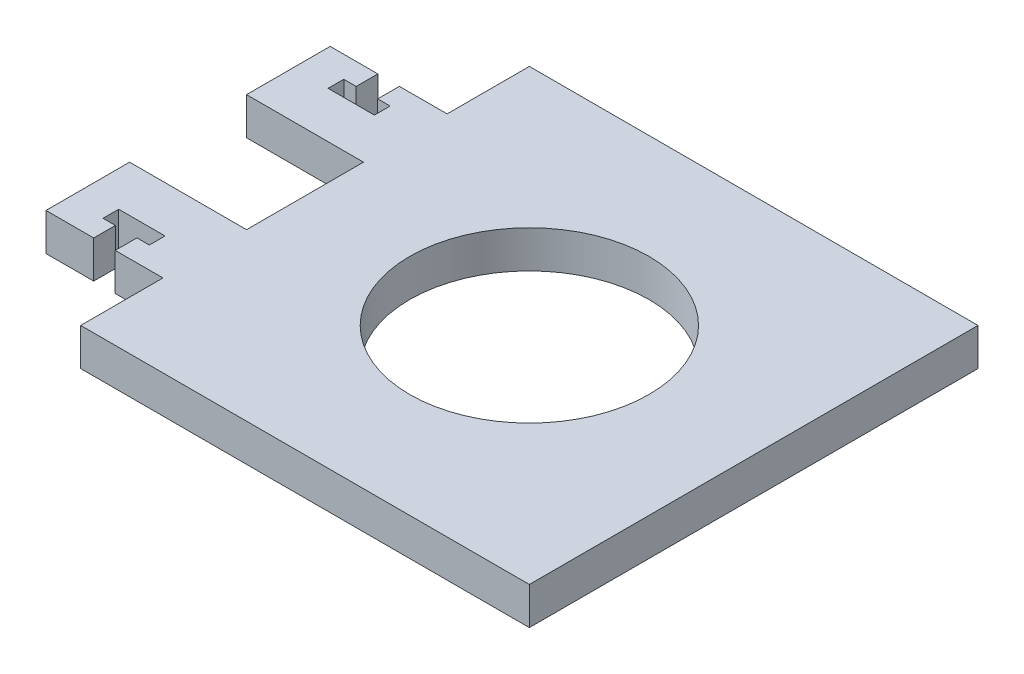
ISO-10303-21;
HEADER;
FILE_DESCRIPTION(('STEP AP214'),'2;1');
FILE_NAME('part.step','',(''),(''),'','','');
FILE_SCHEMA(('AUTOMOTIVE_DESIGN { 1 0 10303 214 1 1 1 1 }'));
ENDSEC;
DATA;
#1=APPLICATION_CONTEXT('core data for automotive mechanical design processes');
#2=APPLICATION_PROTOCOL_DEFINITION('international standard','automotive_design',2000,#1);
#3=PRODUCT_CONTEXT('',#1,'mechanical');
#4=PRODUCT('Part','Part','',(#3));
#5=PRODUCT_RELATED_PRODUCT_CATEGORY('part','',(#4));
#6=PRODUCT_DEFINITION_FORMATION('','',#4);
#7=PRODUCT_DEFINITION_CONTEXT('part definition',#1,'design');
#8=PRODUCT_DEFINITION('design','',#6,#7);
#9=PRODUCT_DEFINITION_SHAPE('','',#8);
#10=(LENGTH_UNIT() NAMED_UNIT(*) SI_UNIT(.MILLI.,.METRE.));
#11=(NAMED_UNIT(*) PLANE_ANGLE_UNIT() SI_UNIT($,.RADIAN.));
#12=(NAMED_UNIT(*) SI_UNIT($,.STERADIAN.) SOLID_ANGLE_UNIT());
#13=UNCERTAINTY_MEASURE_WITH_UNIT(LENGTH_MEASURE(1.E-05),#10,'distance_accuracy_value','');
#14=(GEOMETRIC_REPRESENTATION_CONTEXT(3) GLOBAL_UNCERTAINTY_ASSIGNED_CONTEXT((#13)) GLOBAL_UNIT_ASSIGNED_CONTEXT((#10,
#11,#12)) REPRESENTATION_CONTEXT('',''));
#15=CARTESIAN_POINT('',(0.,0.,0.));
#16=DIRECTION('',(0.,0.,1.));
#17=DIRECTION('',(1.,0.,0.));
#18=AXIS2_PLACEMENT_3D('',#15,#16,#17);
#19=CARTESIAN_POINT('',(38.1000000000002,-6.35,38.1000000000002));
#20=DIRECTION('',(1.,0.,0.));
#21=DIRECTION('',(0.,0.,-1.));
#22=AXIS2_PLACEMENT_3D('',#19,#20,#21);
#23=PLANE('',#22);
#24=DIRECTION('',(0.,0.,-1.));
#25=VECTOR('',#24,1.);
#26=CARTESIAN_POINT('',(38.1000000000002,0.,38.1000000000002));
#27=LINE('',#26,#25);
#28=CARTESIAN_POINT('',(38.1000000000002,0.,38.1000000000002));
#29=VERTEX_POINT('',#28);
#30=CARTESIAN_POINT('',(38.1000000000002,0.,-38.1000000000002));
#31=VERTEX_POINT('',#30);
#32=EDGE_CURVE('E251',#29,#31,#27,.T.);
#33=ORIENTED_EDGE('',*,*,#32,.F.);
#34=DIRECTION('',(0.,1.,0.));
#35=VECTOR('',#34,1.);
#36=CARTESIAN_POINT('',(38.1000000000002,-6.35,38.1000000000002));
#37=LINE('',#36,#35);
#38=CARTESIAN_POINT('',(38.1000000000002,-6.35,38.1000000000002));
#39=VERTEX_POINT('',#38);
#40=EDGE_CURVE('E11',#39,#29,#37,.T.);
#41=ORIENTED_EDGE('',*,*,#40,.F.);
#42=DIRECTION('',(0.,0.,-1.));
#43=VECTOR('',#42,1.);
#44=CARTESIAN_POINT('',(38.1000000000002,-6.35,38.1000000000002));
#45=LINE('',#44,#43);
#46=CARTESIAN_POINT('',(38.1000000000002,-6.35,-38.1000000000002));
#47=VERTEX_POINT('',#46);
#48=EDGE_CURVE('E332',#39,#47,#45,.T.);
#49=ORIENTED_EDGE('',*,*,#48,.T.);
#50=DIRECTION('',(0.,1.,0.));
#51=VECTOR('',#50,1.);
#52=CARTESIAN_POINT('',(38.1000000000002,-6.35,-38.1000000000002));
#53=LINE('',#52,#51);
#54=EDGE_CURVE('E37',#47,#31,#53,.T.);
#55=ORIENTED_EDGE('',*,*,#54,.T.);
#56=EDGE_LOOP('',(#33,#41,#49,#55));
#57=FACE_BOUND('',#56,.T.);
#58=ADVANCED_FACE('F34',(#57),#23,.T.);
#59=CARTESIAN_POINT('',(-38.0999999999998,-6.35,38.1000000000002));
#60=DIRECTION('',(0.,0.,1.));
#61=DIRECTION('',(1.,0.,0.));
#62=AXIS2_PLACEMENT_3D('',#59,#60,#61);
#63=PLANE('',#62);
#64=DIRECTION('',(1.,0.,0.));
#65=VECTOR('',#64,1.);
#66=CARTESIAN_POINT('',(-38.0999999999998,0.,38.1000000000002));
#67=LINE('',#66,#65);
#68=CARTESIAN_POINT('',(-38.0999999999998,0.,38.1000000000002));
#69=VERTEX_POINT('',#68);
#70=EDGE_CURVE('E330',#69,#29,#67,.T.);
#71=ORIENTED_EDGE('',*,*,#70,.F.);
#72=DIRECTION('',(0.,1.,0.));
#73=VECTOR('',#72,1.);
#74=CARTESIAN_POINT('',(-38.0999999999998,-6.35,38.1000000000002));
#75=LINE('',#74,#73);
#76=CARTESIAN_POINT('',(-38.0999999999998,-6.35,38.1000000000002));
#77=VERTEX_POINT('',#76);
#78=EDGE_CURVE('E43',#77,#69,#75,.T.);
#79=ORIENTED_EDGE('',*,*,#78,.F.);
#80=DIRECTION('',(1.,0.,0.));
#81=VECTOR('',#80,1.);
#82=CARTESIAN_POINT('',(-38.0999999999998,-6.35,38.1000000000002));
#83=LINE('',#82,#81);
#84=EDGE_CURVE('E241',#77,#39,#83,.T.);
#85=ORIENTED_EDGE('',*,*,#84,.T.);
#86=ORIENTED_EDGE('',*,*,#40,.T.);
#87=EDGE_LOOP('',(#71,#79,#85,#86));
#88=FACE_BOUND('',#87,.T.);
#89=ADVANCED_FACE('F384',(#88),#63,.T.);
#90=CARTESIAN_POINT('',(-38.0999999999998,-6.35,38.1000000000002));
#91=DIRECTION('',(-1.,0.,0.));
#92=DIRECTION('',(0.,0.,1.));
#93=AXIS2_PLACEMENT_3D('',#90,#91,#92);
#94=PLANE('',#93);
#95=DIRECTION('',(0.,0.,1.));
#96=VECTOR('',#95,1.);
#97=CARTESIAN_POINT('',(-38.0999999999998,0.,38.1000000000002));
#98=LINE('',#97,#96);
#99=CARTESIAN_POINT('',(-38.0999999999998,0.,24.1300000000002));
#100=VERTEX_POINT('',#99);
#101=EDGE_CURVE('E228',#100,#69,#98,.T.);
#102=ORIENTED_EDGE('',*,*,#101,.F.);
#103=DIRECTION('',(0.,1.,0.));
#104=VECTOR('',#103,1.);
#105=CARTESIAN_POINT('',(-38.0999999999998,-6.35,24.1300000000002));
#106=LINE('',#105,#104);
#107=CARTESIAN_POINT('',(-38.0999999999998,-6.35,24.1300000000002));
#108=VERTEX_POINT('',#107);
#109=EDGE_CURVE('E223',#108,#100,#106,.T.);
#110=ORIENTED_EDGE('',*,*,#109,.F.);
#111=DIRECTION('',(0.,0.,1.));
#112=VECTOR('',#111,1.);
#113=CARTESIAN_POINT('',(-38.0999999999998,-6.35,38.1000000000002));
#114=LINE('',#113,#112);
#115=EDGE_CURVE('E226',#108,#77,#114,.T.);
#116=ORIENTED_EDGE('',*,*,#115,.T.);
#117=ORIENTED_EDGE('',*,*,#78,.T.);
#118=EDGE_LOOP('',(#102,#110,#116,#117));
#119=FACE_BOUND('',#118,.T.);
#120=ADVANCED_FACE('F225',(#119),#94,.T.);
#121=CARTESIAN_POINT('',(-38.0999999999998,-6.35,24.1300000000002));
#122=DIRECTION('',(0.,0.,1.));
#123=DIRECTION('',(1.,0.,0.));
#124=AXIS2_PLACEMENT_3D('',#121,#122,#123);
#125=PLANE('',#124);
#126=DIRECTION('',(1.,0.,0.));
#127=VECTOR('',#126,1.);
#128=CARTESIAN_POINT('',(-38.0999999999998,0.,24.1300000000002));
#129=LINE('',#128,#127);
#130=CARTESIAN_POINT('',(-46.2025999999998,0.,24.1300000000001));
#131=VERTEX_POINT('',#130);
#132=EDGE_CURVE('E327',#131,#100,#129,.T.);
#133=ORIENTED_EDGE('',*,*,#132,.F.);
#134=DIRECTION('',(0.,1.,0.));
#135=VECTOR('',#134,1.);
#136=CARTESIAN_POINT('',(-46.2025999999998,-6.35,24.1300000000001));
#137=LINE('',#136,#135);
#138=CARTESIAN_POINT('',(-46.2025999999998,-6.35,24.1300000000001));
#139=VERTEX_POINT('',#138);
#140=EDGE_CURVE('E233',#139,#131,#137,.T.);
#141=ORIENTED_EDGE('',*,*,#140,.F.);
#142=DIRECTION('',(1.,0.,0.));
#143=VECTOR('',#142,1.);
#144=CARTESIAN_POINT('',(-38.0999999999998,-6.35,24.1300000000002));
#145=LINE('',#144,#143);
#146=EDGE_CURVE('E239',#139,#108,#145,.T.);
#147=ORIENTED_EDGE('',*,*,#146,.T.);
#148=ORIENTED_EDGE('',*,*,#109,.T.);
#149=EDGE_LOOP('',(#133,#141,#147,#148));
#150=FACE_BOUND('',#149,.T.);
#151=ADVANCED_FACE('F243',(#150),#125,.T.);
#152=CARTESIAN_POINT('',(-46.2025999999998,-6.35,24.1300000000001));
#153=DIRECTION('',(-1.,0.,0.));
#154=DIRECTION('',(0.,0.,1.));
#155=AXIS2_PLACEMENT_3D('',#152,#153,#154);
#156=PLANE('',#155);
#157=DIRECTION('',(0.,0.,1.));
#158=VECTOR('',#157,1.);
#159=CARTESIAN_POINT('',(-46.2025999999998,0.,24.1300000000001));
#160=LINE('',#159,#158);
#161=CARTESIAN_POINT('',(-46.2025999999998,0.,20.4470000000001));
#162=VERTEX_POINT('',#161);
#163=EDGE_CURVE('E324',#162,#131,#160,.T.);
#164=ORIENTED_EDGE('',*,*,#163,.F.);
#165=DIRECTION('',(0.,1.,0.));
#166=VECTOR('',#165,1.);
#167=CARTESIAN_POINT('',(-46.2025999999998,-6.35,20.4470000000001));
#168=LINE('',#167,#166);
#169=CARTESIAN_POINT('',(-46.2025999999998,-6.35,20.4470000000001));
#170=VERTEX_POINT('',#169);
#171=EDGE_CURVE('E336',#170,#162,#168,.T.);
#172=ORIENTED_EDGE('',*,*,#171,.F.);
#173=DIRECTION('',(0.,0.,1.));
#174=VECTOR('',#173,1.);
#175=CARTESIAN_POINT('',(-46.2025999999998,-6.35,24.1300000000001));
#176=LINE('',#175,#174);
#177=EDGE_CURVE('E244',#170,#139,#176,.T.);
#178=ORIENTED_EDGE('',*,*,#177,.T.);
#179=ORIENTED_EDGE('',*,*,#140,.T.);
#180=EDGE_LOOP('',(#164,#172,#178,#179));
#181=FACE_BOUND('',#180,.T.);
#182=ADVANCED_FACE('F397',(#181),#156,.T.);
#183=CARTESIAN_POINT('',(-46.2025999999998,-6.35,20.4470000000001));
#184=DIRECTION('',(0.,0.,-1.));
#185=DIRECTION('',(-1.,0.,0.));
#186=AXIS2_PLACEMENT_3D('',#183,#184,#185);
#187=PLANE('',#186);
#188=DIRECTION('',(-1.,0.,0.));
#189=VECTOR('',#188,1.);
#190=CARTESIAN_POINT('',(-46.2025999999998,0.,20.4470000000001));
#191=LINE('',#190,#189);
#192=CARTESIAN_POINT('',(-44.0943999999998,0.,20.4470000000001));
#193=VERTEX_POINT('',#192);
#194=EDGE_CURVE('E321',#193,#162,#191,.T.);
#195=ORIENTED_EDGE('',*,*,#194,.F.);
#196=DIRECTION('',(0.,1.,0.));
#197=VECTOR('',#196,1.);
#198=CARTESIAN_POINT('',(-44.0943999999998,-6.35,20.4470000000001));
#199=LINE('',#198,#197);
#200=CARTESIAN_POINT('',(-44.0943999999998,-6.35,20.4470000000001));
#201=VERTEX_POINT('',#200);
#202=EDGE_CURVE('E338',#201,#193,#199,.T.);
#203=ORIENTED_EDGE('',*,*,#202,.F.);
#204=DIRECTION('',(-1.,0.,0.));
#205=VECTOR('',#204,1.);
#206=CARTESIAN_POINT('',(-46.2025999999998,-6.35,20.4470000000001));
#207=LINE('',#206,#205);
#208=EDGE_CURVE('E246',#201,#170,#207,.T.);
#209=ORIENTED_EDGE('',*,*,#208,.T.);
#210=ORIENTED_EDGE('',*,*,#171,.T.);
#211=EDGE_LOOP('',(#195,#203,#209,#210));
#212=FACE_BOUND('',#211,.T.);
#213=ADVANCED_FACE('F400',(#212),#187,.T.);
#214=CARTESIAN_POINT('',(-44.0943999999998,-6.35,20.4470000000001));
#215=DIRECTION('',(-1.,0.,0.));
#216=DIRECTION('',(0.,0.,1.));
#217=AXIS2_PLACEMENT_3D('',#214,#215,#216);
#218=PLANE('',#217);
#219=DIRECTION('',(0.,0.,1.));
#220=VECTOR('',#219,1.);
#221=CARTESIAN_POINT('',(-44.0943999999998,0.,20.4470000000001));
#222=LINE('',#221,#220);
#223=CARTESIAN_POINT('',(-44.0943999999998,0.,17.7800000000002));
#224=VERTEX_POINT('',#223);
#225=EDGE_CURVE('E318',#224,#193,#222,.T.);
#226=ORIENTED_EDGE('',*,*,#225,.F.);
#227=DIRECTION('',(0.,1.,0.));
#228=VECTOR('',#227,1.);
#229=CARTESIAN_POINT('',(-44.0943999999998,-6.35,17.7800000000002));
#230=LINE('',#229,#228);
#231=CARTESIAN_POINT('',(-44.0943999999998,-6.35,17.7800000000002));
#232=VERTEX_POINT('',#231);
#233=EDGE_CURVE('E340',#232,#224,#230,.T.);
#234=ORIENTED_EDGE('',*,*,#233,.F.);
#235=DIRECTION('',(0.,0.,1.));
#236=VECTOR('',#235,1.);
#237=CARTESIAN_POINT('',(-44.0943999999998,-6.35,20.4470000000001));
#238=LINE('',#237,#236);
#239=EDGE_CURVE('E575',#232,#201,#238,.T.);
#240=ORIENTED_EDGE('',*,*,#239,.T.);
#241=ORIENTED_EDGE('',*,*,#202,.T.);
#242=EDGE_LOOP('',(#226,#234,#240,#241));
#243=FACE_BOUND('',#242,.T.);
#244=ADVANCED_FACE('F404',(#243),#218,.T.);
#245=CARTESIAN_POINT('',(-44.0943999999998,-6.35,17.7800000000002));
#246=DIRECTION('',(0.,0.,1.));
#247=DIRECTION('',(1.,0.,0.));
#248=AXIS2_PLACEMENT_3D('',#245,#246,#247);
#249=PLANE('',#248);
#250=DIRECTION('',(1.,0.,0.));
#251=VECTOR('',#250,1.);
#252=CARTESIAN_POINT('',(-44.0943999999998,0.,17.7800000000002));
#253=LINE('',#252,#251);
#254=CARTESIAN_POINT('',(-51.9683999999998,0.,17.7800000000002));
#255=VERTEX_POINT('',#254);
#256=EDGE_CURVE('E315',#255,#224,#253,.T.);
#257=ORIENTED_EDGE('',*,*,#256,.F.);
#258=DIRECTION('',(0.,1.,0.));
#259=VECTOR('',#258,1.);
#260=CARTESIAN_POINT('',(-51.9683999999998,-6.35,17.7800000000002));
#261=LINE('',#260,#259);
#262=CARTESIAN_POINT('',(-51.9683999999998,-6.35,17.7800000000002));
#263=VERTEX_POINT('',#262);
#264=EDGE_CURVE('E342',#263,#255,#261,.T.);
#265=ORIENTED_EDGE('',*,*,#264,.F.);
#266=DIRECTION('',(1.,0.,0.));
#267=VECTOR('',#266,1.);
#268=CARTESIAN_POINT('',(-44.0943999999998,-6.35,17.7800000000002));
#269=LINE('',#268,#267);
#270=EDGE_CURVE('E572',#263,#232,#269,.T.);
#271=ORIENTED_EDGE('',*,*,#270,.T.);
#272=ORIENTED_EDGE('',*,*,#233,.T.);
#273=EDGE_LOOP('',(#257,#265,#271,#272));
#274=FACE_BOUND('',#273,.T.);
#275=ADVANCED_FACE('F408',(#274),#249,.T.);
#276=CARTESIAN_POINT('',(-51.9683999999998,-6.35,20.4470000000001));
#277=DIRECTION('',(1.,0.,0.));
#278=DIRECTION('',(0.,0.,-1.));
#279=AXIS2_PLACEMENT_3D('',#276,#277,#278);
#280=PLANE('',#279);
#281=DIRECTION('',(0.,0.,-1.));
#282=VECTOR('',#281,1.);
#283=CARTESIAN_POINT('',(-51.9683999999998,0.,20.4470000000001));
#284=LINE('',#283,#282);
#285=CARTESIAN_POINT('',(-51.9683999999998,0.,20.4470000000001));
#286=VERTEX_POINT('',#285);
#287=EDGE_CURVE('E312',#286,#255,#284,.T.);
#288=ORIENTED_EDGE('',*,*,#287,.F.);
#289=DIRECTION('',(0.,1.,0.));
#290=VECTOR('',#289,1.);
#291=CARTESIAN_POINT('',(-51.9683999999998,-6.35,20.4470000000001));
#292=LINE('',#291,#290);
#293=CARTESIAN_POINT('',(-51.9683999999998,-6.35,20.4470000000001));
#294=VERTEX_POINT('',#293);
#295=EDGE_CURVE('E344',#294,#286,#292,.T.);
#296=ORIENTED_EDGE('',*,*,#295,.F.);
#297=DIRECTION('',(0.,0.,-1.));
#298=VECTOR('',#297,1.);
#299=CARTESIAN_POINT('',(-51.9683999999998,-6.35,20.4470000000001));
#300=LINE('',#299,#298);
#301=EDGE_CURVE('E569',#294,#263,#300,.T.);
#302=ORIENTED_EDGE('',*,*,#301,.T.);
#303=ORIENTED_EDGE('',*,*,#264,.T.);
#304=EDGE_LOOP('',(#288,#296,#302,#303));
#305=FACE_BOUND('',#304,.T.);
#306=ADVANCED_FACE('F412',(#305),#280,.T.);
#307=CARTESIAN_POINT('',(-49.8601999999998,-6.35,20.4470000000001));
#308=DIRECTION('',(0.,0.,-1.));
#309=DIRECTION('',(-1.,0.,0.));
#310=AXIS2_PLACEMENT_3D('',#307,#308,#309);
#311=PLANE('',#310);
#312=DIRECTION('',(-1.,0.,0.));
#313=VECTOR('',#312,1.);
#314=CARTESIAN_POINT('',(-49.8601999999998,0.,20.4470000000001));
#315=LINE('',#314,#313);
#316=CARTESIAN_POINT('',(-49.8601999999998,0.,20.4470000000001));
#317=VERTEX_POINT('',#316);
#318=EDGE_CURVE('E309',#317,#286,#315,.T.);
#319=ORIENTED_EDGE('',*,*,#318,.F.);
#320=DIRECTION('',(0.,1.,0.));
#321=VECTOR('',#320,1.);
#322=CARTESIAN_POINT('',(-49.8601999999998,-6.35,20.4470000000001));
#323=LINE('',#322,#321);
#324=CARTESIAN_POINT('',(-49.8601999999998,-6.35,20.4470000000001));
#325=VERTEX_POINT('',#324);
#326=EDGE_CURVE('E346',#325,#317,#323,.T.);
#327=ORIENTED_EDGE('',*,*,#326,.F.);
#328=DIRECTION('',(-1.,0.,0.));
#329=VECTOR('',#328,1.);
#330=CARTESIAN_POINT('',(-49.8601999999998,-6.35,20.4470000000001));
#331=LINE('',#330,#329);
#332=EDGE_CURVE('E566',#325,#294,#331,.T.);
#333=ORIENTED_EDGE('',*,*,#332,.T.);
#334=ORIENTED_EDGE('',*,*,#295,.T.);
#335=EDGE_LOOP('',(#319,#327,#333,#334));
#336=FACE_BOUND('',#335,.T.);
#337=ADVANCED_FACE('F416',(#336),#311,.T.);
#338=CARTESIAN_POINT('',(-49.8601999999998,-6.35,24.1300000000001));
#339=DIRECTION('',(1.,0.,0.));
#340=DIRECTION('',(0.,0.,-1.));
#341=AXIS2_PLACEMENT_3D('',#338,#339,#340);
#342=PLANE('',#341);
#343=DIRECTION('',(0.,0.,-1.));
#344=VECTOR('',#343,1.);
#345=CARTESIAN_POINT('',(-49.8601999999998,0.,24.1300000000001));
#346=LINE('',#345,#344);
#347=CARTESIAN_POINT('',(-49.8601999999998,0.,24.1300000000001));
#348=VERTEX_POINT('',#347);
#349=EDGE_CURVE('E306',#348,#317,#346,.T.);
#350=ORIENTED_EDGE('',*,*,#349,.F.);
#351=DIRECTION('',(0.,1.,0.));
#352=VECTOR('',#351,1.);
#353=CARTESIAN_POINT('',(-49.8601999999998,-6.35,24.1300000000001));
#354=LINE('',#353,#352);
#355=CARTESIAN_POINT('',(-49.8601999999998,-6.35,24.1300000000001));
#356=VERTEX_POINT('',#355);
#357=EDGE_CURVE('E348',#356,#348,#354,.T.);
#358=ORIENTED_EDGE('',*,*,#357,.F.);
#359=DIRECTION('',(0.,0.,-1.));
#360=VECTOR('',#359,1.);
#361=CARTESIAN_POINT('',(-49.8601999999998,-6.35,24.1300000000001));
#362=LINE('',#361,#360);
#363=EDGE_CURVE('E563',#356,#325,#362,.T.);
#364=ORIENTED_EDGE('',*,*,#363,.T.);
#365=ORIENTED_EDGE('',*,*,#326,.T.);
#366=EDGE_LOOP('',(#350,#358,#364,#365));
#367=FACE_BOUND('',#366,.T.);
#368=ADVANCED_FACE('F420',(#367),#342,.T.);
#369=CARTESIAN_POINT('',(-49.8601999999998,-6.35,24.1300000000001));
#370=DIRECTION('',(0.,0.,1.));
#371=DIRECTION('',(1.,0.,0.));
#372=AXIS2_PLACEMENT_3D('',#369,#370,#371);
#373=PLANE('',#372);
#374=DIRECTION('',(1.,0.,0.));
#375=VECTOR('',#374,1.);
#376=CARTESIAN_POINT('',(-49.8601999999998,0.,24.1300000000001));
#377=LINE('',#376,#375);
#378=CARTESIAN_POINT('',(-57.9627999999998,0.,24.1300000000002));
#379=VERTEX_POINT('',#378);
#380=EDGE_CURVE('E303',#379,#348,#377,.T.);
#381=ORIENTED_EDGE('',*,*,#380,.F.);
#382=DIRECTION('',(0.,1.,0.));
#383=VECTOR('',#382,1.);
#384=CARTESIAN_POINT('',(-57.9627999999998,-6.35,24.1300000000002));
#385=LINE('',#384,#383);
#386=CARTESIAN_POINT('',(-57.9627999999998,-6.35,24.1300000000002));
#387=VERTEX_POINT('',#386);
#388=EDGE_CURVE('E350',#387,#379,#385,.T.);
#389=ORIENTED_EDGE('',*,*,#388,.F.);
#390=DIRECTION('',(1.,0.,0.));
#391=VECTOR('',#390,1.);
#392=CARTESIAN_POINT('',(-49.8601999999998,-6.35,24.1300000000001));
#393=LINE('',#392,#391);
#394=EDGE_CURVE('E560',#387,#356,#393,.T.);
#395=ORIENTED_EDGE('',*,*,#394,.T.);
#396=ORIENTED_EDGE('',*,*,#357,.T.);
#397=EDGE_LOOP('',(#381,#389,#395,#396));
#398=FACE_BOUND('',#397,.T.);
#399=ADVANCED_FACE('F424',(#398),#373,.T.);
#400=CARTESIAN_POINT('',(-57.9627999999998,-6.35,24.1300000000002));
#401=DIRECTION('',(-1.,0.,0.));
#402=DIRECTION('',(0.,0.,1.));
#403=AXIS2_PLACEMENT_3D('',#400,#401,#402);
#404=PLANE('',#403);
#405=DIRECTION('',(0.,0.,1.));
#406=VECTOR('',#405,1.);
#407=CARTESIAN_POINT('',(-57.9627999999998,0.,24.1300000000002));
#408=LINE('',#407,#406);
#409=CARTESIAN_POINT('',(-57.9627999999998,0.,9.93140000000015));
#410=VERTEX_POINT('',#409);
#411=EDGE_CURVE('E300',#410,#379,#408,.T.);
#412=ORIENTED_EDGE('',*,*,#411,.F.);
#413=DIRECTION('',(0.,1.,0.));
#414=VECTOR('',#413,1.);
#415=CARTESIAN_POINT('',(-57.9627999999998,-6.35,9.93140000000015));
#416=LINE('',#415,#414);
#417=CARTESIAN_POINT('',(-57.9627999999998,-6.35,9.93140000000015));
#418=VERTEX_POINT('',#417);
#419=EDGE_CURVE('E352',#418,#410,#416,.T.);
#420=ORIENTED_EDGE('',*,*,#419,.F.);
#421=DIRECTION('',(0.,0.,1.));
#422=VECTOR('',#421,1.);
#423=CARTESIAN_POINT('',(-57.9627999999998,-6.35,24.1300000000002));
#424=LINE('',#423,#422);
#425=EDGE_CURVE('E557',#418,#387,#424,.T.);
#426=ORIENTED_EDGE('',*,*,#425,.T.);
#427=ORIENTED_EDGE('',*,*,#388,.T.);
#428=EDGE_LOOP('',(#412,#420,#426,#427));
#429=FACE_BOUND('',#428,.T.);
#430=ADVANCED_FACE('F428',(#429),#404,.T.);
#431=CARTESIAN_POINT('',(-57.9627999999998,-6.35,9.93140000000015));
#432=DIRECTION('',(0.,0.,-1.));
#433=DIRECTION('',(-1.,0.,0.));
#434=AXIS2_PLACEMENT_3D('',#431,#432,#433);
#435=PLANE('',#434);
#436=DIRECTION('',(-1.,0.,0.));
#437=VECTOR('',#436,1.);
#438=CARTESIAN_POINT('',(-57.9627999999998,0.,9.93140000000015));
#439=LINE('',#438,#437);
#440=CARTESIAN_POINT('',(-38.0999999999998,0.,9.93140000000015));
#441=VERTEX_POINT('',#440);
#442=EDGE_CURVE('E297',#441,#410,#439,.T.);
#443=ORIENTED_EDGE('',*,*,#442,.F.);
#444=DIRECTION('',(0.,1.,0.));
#445=VECTOR('',#444,1.);
#446=CARTESIAN_POINT('',(-38.0999999999998,-6.35,9.93140000000015));
#447=LINE('',#446,#445);
#448=CARTESIAN_POINT('',(-38.0999999999998,-6.35,9.93140000000015));
#449=VERTEX_POINT('',#448);
#450=EDGE_CURVE('E354',#449,#441,#447,.T.);
#451=ORIENTED_EDGE('',*,*,#450,.F.);
#452=DIRECTION('',(-1.,0.,0.));
#453=VECTOR('',#452,1.);
#454=CARTESIAN_POINT('',(-57.9627999999998,-6.35,9.93140000000015));
#455=LINE('',#454,#453);
#456=EDGE_CURVE('E554',#449,#418,#455,.T.);
#457=ORIENTED_EDGE('',*,*,#456,.T.);
#458=ORIENTED_EDGE('',*,*,#419,.T.);
#459=EDGE_LOOP('',(#443,#451,#457,#458));
#460=FACE_BOUND('',#459,.T.);
#461=ADVANCED_FACE('F432',(#460),#435,.T.);
#462=CARTESIAN_POINT('',(-38.0999999999998,-6.35,9.93140000000015));
#463=DIRECTION('',(-1.,0.,0.));
#464=DIRECTION('',(0.,0.,1.));
#465=AXIS2_PLACEMENT_3D('',#462,#463,#464);
#466=PLANE('',#465);
#467=DIRECTION('',(0.,0.,1.));
#468=VECTOR('',#467,1.);
#469=CARTESIAN_POINT('',(-38.0999999999998,0.,9.93140000000015));
#470=LINE('',#469,#468);
#471=CARTESIAN_POINT('',(-38.0999999999998,0.,-9.93140000000021));
#472=VERTEX_POINT('',#471);
#473=EDGE_CURVE('E294',#472,#441,#470,.T.);
#474=ORIENTED_EDGE('',*,*,#473,.F.);
#475=DIRECTION('',(0.,1.,0.));
#476=VECTOR('',#475,1.);
#477=CARTESIAN_POINT('',(-38.0999999999998,-6.35,-9.93140000000021));
#478=LINE('',#477,#476);
#479=CARTESIAN_POINT('',(-38.0999999999998,-6.35,-9.93140000000021));
#480=VERTEX_POINT('',#479);
#481=EDGE_CURVE('E356',#480,#472,#478,.T.);
#482=ORIENTED_EDGE('',*,*,#481,.F.);
#483=DIRECTION('',(0.,0.,1.));
#484=VECTOR('',#483,1.);
#485=CARTESIAN_POINT('',(-38.0999999999998,-6.35,9.93140000000015));
#486=LINE('',#485,#484);
#487=EDGE_CURVE('E551',#480,#449,#486,.T.);
#488=ORIENTED_EDGE('',*,*,#487,.T.);
#489=ORIENTED_EDGE('',*,*,#450,.T.);
#490=EDGE_LOOP('',(#474,#482,#488,#489));
#491=FACE_BOUND('',#490,.T.);
#492=ADVANCED_FACE('F436',(#491),#466,.T.);
#493=CARTESIAN_POINT('',(-57.9627999999998,-6.35,-9.93140000000022));
#494=DIRECTION('',(0.,0.,1.));
#495=DIRECTION('',(1.,0.,0.));
#496=AXIS2_PLACEMENT_3D('',#493,#494,#495);
#497=PLANE('',#496);
#498=DIRECTION('',(1.,0.,0.));
#499=VECTOR('',#498,1.);
#500=CARTESIAN_POINT('',(-57.9627999999998,0.,-9.93140000000022));
#501=LINE('',#500,#499);
#502=CARTESIAN_POINT('',(-57.9627999999998,0.,-9.93140000000022));
#503=VERTEX_POINT('',#502);
#504=EDGE_CURVE('E291',#503,#472,#501,.T.);
#505=ORIENTED_EDGE('',*,*,#504,.F.);
#506=DIRECTION('',(0.,1.,0.));
#507=VECTOR('',#506,1.);
#508=CARTESIAN_POINT('',(-57.9627999999998,-6.35,-9.93140000000022));
#509=LINE('',#508,#507);
#510=CARTESIAN_POINT('',(-57.9627999999998,-6.35,-9.93140000000022));
#511=VERTEX_POINT('',#510);
#512=EDGE_CURVE('E358',#511,#503,#509,.T.);
#513=ORIENTED_EDGE('',*,*,#512,.F.);
#514=DIRECTION('',(1.,0.,0.));
#515=VECTOR('',#514,1.);
#516=CARTESIAN_POINT('',(-57.9627999999998,-6.35,-9.93140000000022));
#517=LINE('',#516,#515);
#518=EDGE_CURVE('E548',#511,#480,#517,.T.);
#519=ORIENTED_EDGE('',*,*,#518,.T.);
#520=ORIENTED_EDGE('',*,*,#481,.T.);
#521=EDGE_LOOP('',(#505,#513,#519,#520));
#522=FACE_BOUND('',#521,.T.);
#523=ADVANCED_FACE('F440',(#522),#497,.T.);
#524=CARTESIAN_POINT('',(-57.9627999999998,-6.35,-24.1300000000002));
#525=DIRECTION('',(-1.,0.,0.));
#526=DIRECTION('',(0.,0.,1.));
#527=AXIS2_PLACEMENT_3D('',#524,#525,#526);
#528=PLANE('',#527);
#529=DIRECTION('',(0.,0.,1.));
#530=VECTOR('',#529,1.);
#531=CARTESIAN_POINT('',(-57.9627999999998,0.,-24.1300000000002));
#532=LINE('',#531,#530);
#533=CARTESIAN_POINT('',(-57.9627999999998,0.,-24.1300000000002));
#534=VERTEX_POINT('',#533);
#535=EDGE_CURVE('E288',#534,#503,#532,.T.);
#536=ORIENTED_EDGE('',*,*,#535,.F.);
#537=DIRECTION('',(0.,1.,0.));
#538=VECTOR('',#537,1.);
#539=CARTESIAN_POINT('',(-57.9627999999998,-6.35,-24.1300000000002));
#540=LINE('',#539,#538);
#541=CARTESIAN_POINT('',(-57.9627999999998,-6.35,-24.1300000000002));
#542=VERTEX_POINT('',#541);
#543=EDGE_CURVE('E360',#542,#534,#540,.T.);
#544=ORIENTED_EDGE('',*,*,#543,.F.);
#545=DIRECTION('',(0.,0.,1.));
#546=VECTOR('',#545,1.);
#547=CARTESIAN_POINT('',(-57.9627999999998,-6.35,-24.1300000000002));
#548=LINE('',#547,#546);
#549=EDGE_CURVE('E545',#542,#511,#548,.T.);
#550=ORIENTED_EDGE('',*,*,#549,.T.);
#551=ORIENTED_EDGE('',*,*,#512,.T.);
#552=EDGE_LOOP('',(#536,#544,#550,#551));
#553=FACE_BOUND('',#552,.T.);
#554=ADVANCED_FACE('F444',(#553),#528,.T.);
#555=CARTESIAN_POINT('',(-49.8601999999998,-6.35,-24.1300000000002));
#556=DIRECTION('',(0.,0.,-1.));
#557=DIRECTION('',(-1.,0.,0.));
#558=AXIS2_PLACEMENT_3D('',#555,#556,#557);
#559=PLANE('',#558);
#560=DIRECTION('',(-1.,0.,0.));
#561=VECTOR('',#560,1.);
#562=CARTESIAN_POINT('',(-49.8601999999998,0.,-24.1300000000002));
#563=LINE('',#562,#561);
#564=CARTESIAN_POINT('',(-49.8601999999998,0.,-24.1300000000002));
#565=VERTEX_POINT('',#564);
#566=EDGE_CURVE('E285',#565,#534,#563,.T.);
#567=ORIENTED_EDGE('',*,*,#566,.F.);
#568=DIRECTION('',(0.,1.,0.));
#569=VECTOR('',#568,1.);
#570=CARTESIAN_POINT('',(-49.8601999999998,-6.35,-24.1300000000002));
#571=LINE('',#570,#569);
#572=CARTESIAN_POINT('',(-49.8601999999998,-6.35,-24.1300000000002));
#573=VERTEX_POINT('',#572);
#574=EDGE_CURVE('E362',#573,#565,#571,.T.);
#575=ORIENTED_EDGE('',*,*,#574,.F.);
#576=DIRECTION('',(-1.,0.,0.));
#577=VECTOR('',#576,1.);
#578=CARTESIAN_POINT('',(-49.8601999999998,-6.35,-24.1300000000002));
#579=LINE('',#578,#577);
#580=EDGE_CURVE('E542',#573,#542,#579,.T.);
#581=ORIENTED_EDGE('',*,*,#580,.T.);
#582=ORIENTED_EDGE('',*,*,#543,.T.);
#583=EDGE_LOOP('',(#567,#575,#581,#582));
#584=FACE_BOUND('',#583,.T.);
#585=ADVANCED_FACE('F448',(#584),#559,.T.);
#586=CARTESIAN_POINT('',(-49.8601999999998,-6.35,-24.1300000000002));
#587=DIRECTION('',(1.,0.,0.));
#588=DIRECTION('',(0.,0.,-1.));
#589=AXIS2_PLACEMENT_3D('',#586,#587,#588);
#590=PLANE('',#589);
#591=DIRECTION('',(0.,0.,-1.));
#592=VECTOR('',#591,1.);
#593=CARTESIAN_POINT('',(-49.8601999999998,0.,-24.1300000000002));
#594=LINE('',#593,#592);
#595=CARTESIAN_POINT('',(-49.8601999999998,0.,-20.4470000000002));
#596=VERTEX_POINT('',#595);
#597=EDGE_CURVE('E282',#596,#565,#594,.T.);
#598=ORIENTED_EDGE('',*,*,#597,.F.);
#599=DIRECTION('',(0.,1.,0.));
#600=VECTOR('',#599,1.);
#601=CARTESIAN_POINT('',(-49.8601999999998,-6.35,-20.4470000000002));
#602=LINE('',#601,#600);
#603=CARTESIAN_POINT('',(-49.8601999999998,-6.35,-20.4470000000002));
#604=VERTEX_POINT('',#603);
#605=EDGE_CURVE('E364',#604,#596,#602,.T.);
#606=ORIENTED_EDGE('',*,*,#605,.F.);
#607=DIRECTION('',(0.,0.,-1.));
#608=VECTOR('',#607,1.);
#609=CARTESIAN_POINT('',(-49.8601999999998,-6.35,-24.1300000000002));
#610=LINE('',#609,#608);
#611=EDGE_CURVE('E539',#604,#573,#610,.T.);
#612=ORIENTED_EDGE('',*,*,#611,.T.);
#613=ORIENTED_EDGE('',*,*,#574,.T.);
#614=EDGE_LOOP('',(#598,#606,#612,#613));
#615=FACE_BOUND('',#614,.T.);
#616=ADVANCED_FACE('F452',(#615),#590,.T.);
#617=CARTESIAN_POINT('',(-49.8601999999998,-6.35,-20.4470000000002));
#618=DIRECTION('',(0.,0.,1.));
#619=DIRECTION('',(1.,0.,0.));
#620=AXIS2_PLACEMENT_3D('',#617,#618,#619);
#621=PLANE('',#620);
#622=DIRECTION('',(1.,0.,0.));
#623=VECTOR('',#622,1.);
#624=CARTESIAN_POINT('',(-49.8601999999998,0.,-20.4470000000002));
#625=LINE('',#624,#623);
#626=CARTESIAN_POINT('',(-51.9683999999998,0.,-20.4470000000002));
#627=VERTEX_POINT('',#626);
#628=EDGE_CURVE('E279',#627,#596,#625,.T.);
#629=ORIENTED_EDGE('',*,*,#628,.F.);
#630=DIRECTION('',(0.,1.,0.));
#631=VECTOR('',#630,1.);
#632=CARTESIAN_POINT('',(-51.9683999999998,-6.35,-20.4470000000002));
#633=LINE('',#632,#631);
#634=CARTESIAN_POINT('',(-51.9683999999998,-6.35,-20.4470000000002));
#635=VERTEX_POINT('',#634);
#636=EDGE_CURVE('E366',#635,#627,#633,.T.);
#637=ORIENTED_EDGE('',*,*,#636,.F.);
#638=DIRECTION('',(1.,0.,0.));
#639=VECTOR('',#638,1.);
#640=CARTESIAN_POINT('',(-49.8601999999998,-6.35,-20.4470000000002));
#641=LINE('',#640,#639);
#642=EDGE_CURVE('E536',#635,#604,#641,.T.);
#643=ORIENTED_EDGE('',*,*,#642,.T.);
#644=ORIENTED_EDGE('',*,*,#605,.T.);
#645=EDGE_LOOP('',(#629,#637,#643,#644));
#646=FACE_BOUND('',#645,.T.);
#647=ADVANCED_FACE('F456',(#646),#621,.T.);
#648=CARTESIAN_POINT('',(-51.9683999999998,-6.35,-20.4470000000002));
#649=DIRECTION('',(1.,0.,0.));
#650=DIRECTION('',(0.,0.,-1.));
#651=AXIS2_PLACEMENT_3D('',#648,#649,#650);
#652=PLANE('',#651);
#653=DIRECTION('',(0.,0.,-1.));
#654=VECTOR('',#653,1.);
#655=CARTESIAN_POINT('',(-51.9683999999998,0.,-20.4470000000002));
#656=LINE('',#655,#654);
#657=CARTESIAN_POINT('',(-51.9683999999998,0.,-17.7800000000002));
#658=VERTEX_POINT('',#657);
#659=EDGE_CURVE('E276',#658,#627,#656,.T.);
#660=ORIENTED_EDGE('',*,*,#659,.F.);
#661=DIRECTION('',(0.,1.,0.));
#662=VECTOR('',#661,1.);
#663=CARTESIAN_POINT('',(-51.9683999999998,-6.35,-17.7800000000002));
#664=LINE('',#663,#662);
#665=CARTESIAN_POINT('',(-51.9683999999998,-6.35,-17.7800000000002));
#666=VERTEX_POINT('',#665);
#667=EDGE_CURVE('E368',#666,#658,#664,.T.);
#668=ORIENTED_EDGE('',*,*,#667,.F.);
#669=DIRECTION('',(0.,0.,-1.));
#670=VECTOR('',#669,1.);
#671=CARTESIAN_POINT('',(-51.9683999999998,-6.35,-20.4470000000002));
#672=LINE('',#671,#670);
#673=EDGE_CURVE('E533',#666,#635,#672,.T.);
#674=ORIENTED_EDGE('',*,*,#673,.T.);
#675=ORIENTED_EDGE('',*,*,#636,.T.);
#676=EDGE_LOOP('',(#660,#668,#674,#675));
#677=FACE_BOUND('',#676,.T.);
#678=ADVANCED_FACE('F460',(#677),#652,.T.);
#679=CARTESIAN_POINT('',(-44.0943999999998,-6.35,-17.7800000000002));
#680=DIRECTION('',(0.,0.,-1.));
#681=DIRECTION('',(-1.,0.,0.));
#682=AXIS2_PLACEMENT_3D('',#679,#680,#681);
#683=PLANE('',#682);
#684=DIRECTION('',(-1.,0.,0.));
#685=VECTOR('',#684,1.);
#686=CARTESIAN_POINT('',(-44.0943999999998,0.,-17.7800000000002));
#687=LINE('',#686,#685);
#688=CARTESIAN_POINT('',(-44.0943999999998,0.,-17.7800000000002));
#689=VERTEX_POINT('',#688);
#690=EDGE_CURVE('E273',#689,#658,#687,.T.);
#691=ORIENTED_EDGE('',*,*,#690,.F.);
#692=DIRECTION('',(0.,1.,0.));
#693=VECTOR('',#692,1.);
#694=CARTESIAN_POINT('',(-44.0943999999998,-6.35,-17.7800000000002));
#695=LINE('',#694,#693);
#696=CARTESIAN_POINT('',(-44.0943999999998,-6.35,-17.7800000000002));
#697=VERTEX_POINT('',#696);
#698=EDGE_CURVE('E370',#697,#689,#695,.T.);
#699=ORIENTED_EDGE('',*,*,#698,.F.);
#700=DIRECTION('',(-1.,0.,0.));
#701=VECTOR('',#700,1.);
#702=CARTESIAN_POINT('',(-44.0943999999998,-6.35,-17.7800000000002));
#703=LINE('',#702,#701);
#704=EDGE_CURVE('E530',#697,#666,#703,.T.);
#705=ORIENTED_EDGE('',*,*,#704,.T.);
#706=ORIENTED_EDGE('',*,*,#667,.T.);
#707=EDGE_LOOP('',(#691,#699,#705,#706));
#708=FACE_BOUND('',#707,.T.);
#709=ADVANCED_FACE('F464',(#708),#683,.T.);
#710=CARTESIAN_POINT('',(-44.0943999999998,-6.35,-20.4470000000002));
#711=DIRECTION('',(-1.,0.,0.));
#712=DIRECTION('',(0.,0.,1.));
#713=AXIS2_PLACEMENT_3D('',#710,#711,#712);
#714=PLANE('',#713);
#715=DIRECTION('',(0.,0.,1.));
#716=VECTOR('',#715,1.);
#717=CARTESIAN_POINT('',(-44.0943999999998,0.,-20.4470000000002));
#718=LINE('',#717,#716);
#719=CARTESIAN_POINT('',(-44.0943999999998,0.,-20.4470000000002));
#720=VERTEX_POINT('',#719);
#721=EDGE_CURVE('E270',#720,#689,#718,.T.);
#722=ORIENTED_EDGE('',*,*,#721,.F.);
#723=DIRECTION('',(0.,1.,0.));
#724=VECTOR('',#723,1.);
#725=CARTESIAN_POINT('',(-44.0943999999998,-6.35,-20.4470000000002));
#726=LINE('',#725,#724);
#727=CARTESIAN_POINT('',(-44.0943999999998,-6.35,-20.4470000000002));
#728=VERTEX_POINT('',#727);
#729=EDGE_CURVE('E372',#728,#720,#726,.T.);
#730=ORIENTED_EDGE('',*,*,#729,.F.);
#731=DIRECTION('',(0.,0.,1.));
#732=VECTOR('',#731,1.);
#733=CARTESIAN_POINT('',(-44.0943999999998,-6.35,-20.4470000000002));
#734=LINE('',#733,#732);
#735=EDGE_CURVE('E527',#728,#697,#734,.T.);
#736=ORIENTED_EDGE('',*,*,#735,.T.);
#737=ORIENTED_EDGE('',*,*,#698,.T.);
#738=EDGE_LOOP('',(#722,#730,#736,#737));
#739=FACE_BOUND('',#738,.T.);
#740=ADVANCED_FACE('F468',(#739),#714,.T.);
#741=CARTESIAN_POINT('',(-46.2025999999998,-6.35,-20.4470000000002));
#742=DIRECTION('',(0.,0.,1.));
#743=DIRECTION('',(1.,0.,0.));
#744=AXIS2_PLACEMENT_3D('',#741,#742,#743);
#745=PLANE('',#744);
#746=DIRECTION('',(1.,0.,0.));
#747=VECTOR('',#746,1.);
#748=CARTESIAN_POINT('',(-46.2025999999998,0.,-20.4470000000002));
#749=LINE('',#748,#747);
#750=CARTESIAN_POINT('',(-46.2025999999998,0.,-20.4470000000002));
#751=VERTEX_POINT('',#750);
#752=EDGE_CURVE('E267',#751,#720,#749,.T.);
#753=ORIENTED_EDGE('',*,*,#752,.F.);
#754=DIRECTION('',(0.,1.,0.));
#755=VECTOR('',#754,1.);
#756=CARTESIAN_POINT('',(-46.2025999999998,-6.35,-20.4470000000002));
#757=LINE('',#756,#755);
#758=CARTESIAN_POINT('',(-46.2025999999998,-6.35,-20.4470000000002));
#759=VERTEX_POINT('',#758);
#760=EDGE_CURVE('E374',#759,#751,#757,.T.);
#761=ORIENTED_EDGE('',*,*,#760,.F.);
#762=DIRECTION('',(1.,0.,0.));
#763=VECTOR('',#762,1.);
#764=CARTESIAN_POINT('',(-46.2025999999998,-6.35,-20.4470000000002));
#765=LINE('',#764,#763);
#766=EDGE_CURVE('E524',#759,#728,#765,.T.);
#767=ORIENTED_EDGE('',*,*,#766,.T.);
#768=ORIENTED_EDGE('',*,*,#729,.T.);
#769=EDGE_LOOP('',(#753,#761,#767,#768));
#770=FACE_BOUND('',#769,.T.);
#771=ADVANCED_FACE('F472',(#770),#745,.T.);
#772=CARTESIAN_POINT('',(-46.2025999999998,-6.35,-24.1300000000002));
#773=DIRECTION('',(-1.,0.,0.));
#774=DIRECTION('',(0.,0.,1.));
#775=AXIS2_PLACEMENT_3D('',#772,#773,#774);
#776=PLANE('',#775);
#777=DIRECTION('',(0.,0.,1.));
#778=VECTOR('',#777,1.);
#779=CARTESIAN_POINT('',(-46.2025999999998,0.,-24.1300000000002));
#780=LINE('',#779,#778);
#781=CARTESIAN_POINT('',(-46.2025999999998,0.,-24.1300000000002));
#782=VERTEX_POINT('',#781);
#783=EDGE_CURVE('E264',#782,#751,#780,.T.);
#784=ORIENTED_EDGE('',*,*,#783,.F.);
#785=DIRECTION('',(0.,1.,0.));
#786=VECTOR('',#785,1.);
#787=CARTESIAN_POINT('',(-46.2025999999998,-6.35,-24.1300000000002));
#788=LINE('',#787,#786);
#789=CARTESIAN_POINT('',(-46.2025999999998,-6.35,-24.1300000000002));
#790=VERTEX_POINT('',#789);
#791=EDGE_CURVE('E376',#790,#782,#788,.T.);
#792=ORIENTED_EDGE('',*,*,#791,.F.);
#793=DIRECTION('',(0.,0.,1.));
#794=VECTOR('',#793,1.);
#795=CARTESIAN_POINT('',(-46.2025999999998,-6.35,-24.1300000000002));
#796=LINE('',#795,#794);
#797=EDGE_CURVE('E521',#790,#759,#796,.T.);
#798=ORIENTED_EDGE('',*,*,#797,.T.);
#799=ORIENTED_EDGE('',*,*,#760,.T.);
#800=EDGE_LOOP('',(#784,#792,#798,#799));
#801=FACE_BOUND('',#800,.T.);
#802=ADVANCED_FACE('F476',(#801),#776,.T.);
#803=CARTESIAN_POINT('',(-38.0999999999998,-6.35,-24.1300000000002));
#804=DIRECTION('',(0.,0.,-1.));
#805=DIRECTION('',(-1.,0.,0.));
#806=AXIS2_PLACEMENT_3D('',#803,#804,#805);
#807=PLANE('',#806);
#808=DIRECTION('',(-1.,0.,0.));
#809=VECTOR('',#808,1.);
#810=CARTESIAN_POINT('',(-38.0999999999998,0.,-24.1300000000002));
#811=LINE('',#810,#809);
#812=CARTESIAN_POINT('',(-38.0999999999998,0.,-24.1300000000002));
#813=VERTEX_POINT('',#812);
#814=EDGE_CURVE('E261',#813,#782,#811,.T.);
#815=ORIENTED_EDGE('',*,*,#814,.F.);
#816=DIRECTION('',(0.,1.,0.));
#817=VECTOR('',#816,1.);
#818=CARTESIAN_POINT('',(-38.0999999999998,-6.35,-24.1300000000002));
#819=LINE('',#818,#817);
#820=CARTESIAN_POINT('',(-38.0999999999998,-6.35,-24.1300000000002));
#821=VERTEX_POINT('',#820);
#822=EDGE_CURVE('E378',#821,#813,#819,.T.);
#823=ORIENTED_EDGE('',*,*,#822,.F.);
#824=DIRECTION('',(-1.,0.,0.));
#825=VECTOR('',#824,1.);
#826=CARTESIAN_POINT('',(-38.0999999999998,-6.35,-24.1300000000002));
#827=LINE('',#826,#825);
#828=EDGE_CURVE('E518',#821,#790,#827,.T.);
#829=ORIENTED_EDGE('',*,*,#828,.T.);
#830=ORIENTED_EDGE('',*,*,#791,.T.);
#831=EDGE_LOOP('',(#815,#823,#829,#830));
#832=FACE_BOUND('',#831,.T.);
#833=ADVANCED_FACE('F480',(#832),#807,.T.);
#834=CARTESIAN_POINT('',(-38.0999999999998,-6.35,-24.1300000000002));
#835=DIRECTION('',(-1.,0.,0.));
#836=DIRECTION('',(0.,0.,1.));
#837=AXIS2_PLACEMENT_3D('',#834,#835,#836);
#838=PLANE('',#837);
#839=DIRECTION('',(0.,0.,1.));
#840=VECTOR('',#839,1.);
#841=CARTESIAN_POINT('',(-38.0999999999998,0.,-24.1300000000002));
#842=LINE('',#841,#840);
#843=CARTESIAN_POINT('',(-38.0999999999998,0.,-38.1000000000002));
#844=VERTEX_POINT('',#843);
#845=EDGE_CURVE('E258',#844,#813,#842,.T.);
#846=ORIENTED_EDGE('',*,*,#845,.F.);
#847=DIRECTION('',(0.,1.,0.));
#848=VECTOR('',#847,1.);
#849=CARTESIAN_POINT('',(-38.0999999999998,-6.35,-38.1000000000002));
#850=LINE('',#849,#848);
#851=CARTESIAN_POINT('',(-38.0999999999998,-6.35,-38.1000000000002));
#852=VERTEX_POINT('',#851);
#853=EDGE_CURVE('E379',#852,#844,#850,.T.);
#854=ORIENTED_EDGE('',*,*,#853,.F.);
#855=DIRECTION('',(0.,0.,1.));
#856=VECTOR('',#855,1.);
#857=CARTESIAN_POINT('',(-38.0999999999998,-6.35,-24.1300000000002));
#858=LINE('',#857,#856);
#859=EDGE_CURVE('E515',#852,#821,#858,.T.);
#860=ORIENTED_EDGE('',*,*,#859,.T.);
#861=ORIENTED_EDGE('',*,*,#822,.T.);
#862=EDGE_LOOP('',(#846,#854,#860,#861));
#863=FACE_BOUND('',#862,.T.);
#864=ADVANCED_FACE('F484',(#863),#838,.T.);
#865=CARTESIAN_POINT('',(-38.0999999999998,-6.35,-38.1000000000002));
#866=DIRECTION('',(0.,0.,-1.));
#867=DIRECTION('',(-1.,0.,0.));
#868=AXIS2_PLACEMENT_3D('',#865,#866,#867);
#869=PLANE('',#868);
#870=DIRECTION('',(-1.,0.,0.));
#871=VECTOR('',#870,1.);
#872=CARTESIAN_POINT('',(-38.0999999999998,0.,-38.1000000000002));
#873=LINE('',#872,#871);
#874=EDGE_CURVE('E254',#31,#844,#873,.T.);
#875=ORIENTED_EDGE('',*,*,#874,.F.);
#876=ORIENTED_EDGE('',*,*,#54,.F.);
#877=DIRECTION('',(-1.,0.,0.));
#878=VECTOR('',#877,1.);
#879=CARTESIAN_POINT('',(-38.0999999999998,-6.35,-38.1000000000002));
#880=LINE('',#879,#878);
#881=EDGE_CURVE('E513',#47,#852,#880,.T.);
#882=ORIENTED_EDGE('',*,*,#881,.T.);
#883=ORIENTED_EDGE('',*,*,#853,.T.);
#884=EDGE_LOOP('',(#875,#876,#882,#883));
#885=FACE_BOUND('',#884,.T.);
#886=ADVANCED_FACE('F381',(#885),#869,.T.);
#887=CARTESIAN_POINT('',(0.,-6.35,0.));
#888=DIRECTION('',(0.,-1.,0.));
#889=DIRECTION('',(0.,0.,-1.));
#890=AXIS2_PLACEMENT_3D('',#887,#888,#889);
#891=PLANE('',#890);
#892=CARTESIAN_POINT('',(0.,-6.35,0.));
#893=DIRECTION('',(0.,1.,0.));
#894=DIRECTION('',(0.,0.,1.));
#895=AXIS2_PLACEMENT_3D('',#892,#893,#894);
#896=CIRCLE('',#895,20.32);
#897=CARTESIAN_POINT('',(0.,-6.35,20.32));
#898=VERTEX_POINT('',#897);
#899=EDGE_CURVE('E255',#898,#898,#896,.T.);
#900=ORIENTED_EDGE('',*,*,#899,.T.);
#901=EDGE_LOOP('',(#900));
#902=FACE_BOUND('',#901,.T.);
#903=ORIENTED_EDGE('',*,*,#48,.F.);
#904=ORIENTED_EDGE('',*,*,#84,.F.);
#905=ORIENTED_EDGE('',*,*,#115,.F.);
#906=ORIENTED_EDGE('',*,*,#146,.F.);
#907=ORIENTED_EDGE('',*,*,#177,.F.);
#908=ORIENTED_EDGE('',*,*,#208,.F.);
#909=ORIENTED_EDGE('',*,*,#239,.F.);
#910=ORIENTED_EDGE('',*,*,#270,.F.);
#911=ORIENTED_EDGE('',*,*,#301,.F.);
#912=ORIENTED_EDGE('',*,*,#332,.F.);
#913=ORIENTED_EDGE('',*,*,#363,.F.);
#914=ORIENTED_EDGE('',*,*,#394,.F.);
#915=ORIENTED_EDGE('',*,*,#425,.F.);
#916=ORIENTED_EDGE('',*,*,#456,.F.);
#917=ORIENTED_EDGE('',*,*,#487,.F.);
#918=ORIENTED_EDGE('',*,*,#518,.F.);
#919=ORIENTED_EDGE('',*,*,#549,.F.);
#920=ORIENTED_EDGE('',*,*,#580,.F.);
#921=ORIENTED_EDGE('',*,*,#611,.F.);
#922=ORIENTED_EDGE('',*,*,#642,.F.);
#923=ORIENTED_EDGE('',*,*,#673,.F.);
#924=ORIENTED_EDGE('',*,*,#704,.F.);
#925=ORIENTED_EDGE('',*,*,#735,.F.);
#926=ORIENTED_EDGE('',*,*,#766,.F.);
#927=ORIENTED_EDGE('',*,*,#797,.F.);
#928=ORIENTED_EDGE('',*,*,#828,.F.);
#929=ORIENTED_EDGE('',*,*,#859,.F.);
#930=ORIENTED_EDGE('',*,*,#881,.F.);
#931=EDGE_LOOP('',(#903,#904,#905,#906,#907,#908,#909,#910,#911,#912,#913,#914,#915,#916,#917,
#918,#919,#920,#921,#922,#923,#924,#925,#926,#927,#928,#929,#930));
#932=FACE_BOUND('',#931,.T.);
#933=ADVANCED_FACE('F237',(#902,#932),#891,.T.);
#934=CARTESIAN_POINT('',(0.,0.,0.));
#935=DIRECTION('',(0.,-1.,0.));
#936=DIRECTION('',(0.,0.,-1.));
#937=AXIS2_PLACEMENT_3D('',#934,#935,#936);
#938=PLANE('',#937);
#939=CARTESIAN_POINT('',(0.,0.,0.));
#940=DIRECTION('',(0.,1.,0.));
#941=DIRECTION('',(0.,0.,1.));
#942=AXIS2_PLACEMENT_3D('',#939,#940,#941);
#943=CIRCLE('',#942,20.32);
#944=CARTESIAN_POINT('',(0.,0.,20.32));
#945=VERTEX_POINT('',#944);
#946=EDGE_CURVE('E508',#945,#945,#943,.T.);
#947=ORIENTED_EDGE('',*,*,#946,.F.);
#948=EDGE_LOOP('',(#947));
#949=FACE_BOUND('',#948,.T.);
#950=ORIENTED_EDGE('',*,*,#32,.T.);
#951=ORIENTED_EDGE('',*,*,#874,.T.);
#952=ORIENTED_EDGE('',*,*,#845,.T.);
#953=ORIENTED_EDGE('',*,*,#814,.T.);
#954=ORIENTED_EDGE('',*,*,#783,.T.);
#955=ORIENTED_EDGE('',*,*,#752,.T.);
#956=ORIENTED_EDGE('',*,*,#721,.T.);
#957=ORIENTED_EDGE('',*,*,#690,.T.);
#958=ORIENTED_EDGE('',*,*,#659,.T.);
#959=ORIENTED_EDGE('',*,*,#628,.T.);
#960=ORIENTED_EDGE('',*,*,#597,.T.);
#961=ORIENTED_EDGE('',*,*,#566,.T.);
#962=ORIENTED_EDGE('',*,*,#535,.T.);
#963=ORIENTED_EDGE('',*,*,#504,.T.);
#964=ORIENTED_EDGE('',*,*,#473,.T.);
#965=ORIENTED_EDGE('',*,*,#442,.T.);
#966=ORIENTED_EDGE('',*,*,#411,.T.);
#967=ORIENTED_EDGE('',*,*,#380,.T.);
#968=ORIENTED_EDGE('',*,*,#349,.T.);
#969=ORIENTED_EDGE('',*,*,#318,.T.);
#970=ORIENTED_EDGE('',*,*,#287,.T.);
#971=ORIENTED_EDGE('',*,*,#256,.T.);
#972=ORIENTED_EDGE('',*,*,#225,.T.);
#973=ORIENTED_EDGE('',*,*,#194,.T.);
#974=ORIENTED_EDGE('',*,*,#163,.T.);
#975=ORIENTED_EDGE('',*,*,#132,.T.);
#976=ORIENTED_EDGE('',*,*,#101,.T.);
#977=ORIENTED_EDGE('',*,*,#70,.T.);
#978=EDGE_LOOP('',(#950,#951,#952,#953,#954,#955,#956,#957,#958,#959,#960,#961,#962,#963,#964,
#965,#966,#967,#968,#969,#970,#971,#972,#973,#974,#975,#976,#977));
#979=FACE_BOUND('',#978,.T.);
#980=ADVANCED_FACE('F383',(#949,#979),#938,.F.);
#981=CARTESIAN_POINT('',(0.,-6.35,0.));
#982=DIRECTION('',(0.,1.,0.));
#983=DIRECTION('',(0.,0.,1.));
#984=AXIS2_PLACEMENT_3D('',#981,#982,#983);
#985=CYLINDRICAL_SURFACE('',#984,20.32);
#986=ORIENTED_EDGE('',*,*,#899,.F.);
#987=EDGE_LOOP('',(#986));
#988=FACE_BOUND('',#987,.T.);
#989=ORIENTED_EDGE('',*,*,#946,.T.);
#990=EDGE_LOOP('',(#989));
#991=FACE_BOUND('',#990,.T.);
#992=ADVANCED_FACE('F496',(#988,#991),#985,.F.);
#993=CLOSED_SHELL('',(#58,#89,#120,#151,#182,#213,#244,#275,#306,#337,#368,#399,#430,#461,#492,
#523,#554,#585,#616,#647,#678,#709,#740,#771,#802,#833,#864,#886,#933,#980,#992));
#994=MANIFOLD_SOLID_BREP('B2',#993);
#995=ADVANCED_BREP_SHAPE_REPRESENTATION('',(#18,#994),#14);
#996=SHAPE_DEFINITION_REPRESENTATION(#9,#995);
ENDSEC;
END-ISO-10303-21;
